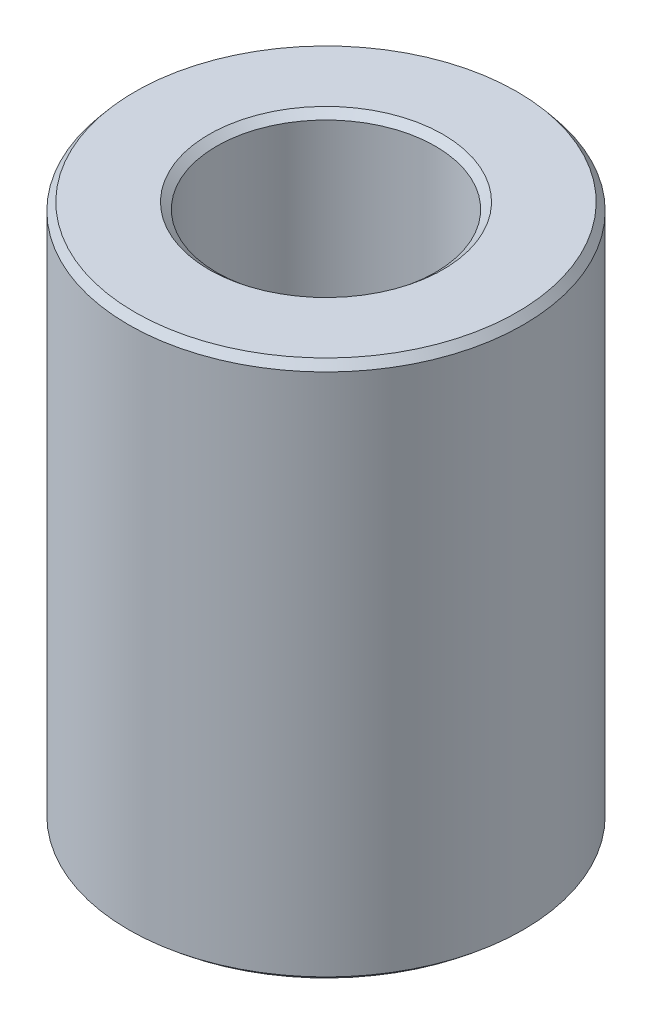
ISO-10303-21;
HEADER;
FILE_DESCRIPTION(('STEP AP214'),'2;1');
FILE_NAME('part.step','',(''),(''),'','','');
FILE_SCHEMA(('AUTOMOTIVE_DESIGN { 1 0 10303 214 1 1 1 1 }'));
ENDSEC;
DATA;
#1=APPLICATION_CONTEXT('core data for automotive mechanical design processes');
#2=APPLICATION_PROTOCOL_DEFINITION('international standard','automotive_design',2000,#1);
#3=PRODUCT_CONTEXT('',#1,'mechanical');
#4=PRODUCT('Part','Part','',(#3));
#5=PRODUCT_RELATED_PRODUCT_CATEGORY('part','',(#4));
#6=PRODUCT_DEFINITION_FORMATION('','',#4);
#7=PRODUCT_DEFINITION_CONTEXT('part definition',#1,'design');
#8=PRODUCT_DEFINITION('design','',#6,#7);
#9=PRODUCT_DEFINITION_SHAPE('','',#8);
#10=(LENGTH_UNIT() NAMED_UNIT(*) SI_UNIT(.MILLI.,.METRE.));
#11=(NAMED_UNIT(*) PLANE_ANGLE_UNIT() SI_UNIT($,.RADIAN.));
#12=(NAMED_UNIT(*) SI_UNIT($,.STERADIAN.) SOLID_ANGLE_UNIT());
#13=UNCERTAINTY_MEASURE_WITH_UNIT(LENGTH_MEASURE(1.E-05),#10,'distance_accuracy_value','');
#14=(GEOMETRIC_REPRESENTATION_CONTEXT(3) GLOBAL_UNCERTAINTY_ASSIGNED_CONTEXT((#13)) GLOBAL_UNIT_ASSIGNED_CONTEXT((#10,
#11,#12)) REPRESENTATION_CONTEXT('',''));
#15=CARTESIAN_POINT('',(0.,0.,0.));
#16=DIRECTION('',(0.,0.,1.));
#17=DIRECTION('',(1.,0.,0.));
#18=AXIS2_PLACEMENT_3D('',#15,#16,#17);
#19=CARTESIAN_POINT('',(0.,108.992177685298,0.));
#20=DIRECTION('',(0.,-1.,0.));
#21=DIRECTION('',(0.,0.,-1.));
#22=AXIS2_PLACEMENT_3D('',#19,#20,#21);
#23=CYLINDRICAL_SURFACE('',#22,40.);
#24=CARTESIAN_POINT('',(0.,1.28444051378342,0.));
#25=DIRECTION('',(0.,1.,0.));
#26=DIRECTION('',(0.,0.,1.));
#27=AXIS2_PLACEMENT_3D('',#24,#25,#26);
#28=CIRCLE('',#27,40.);
#29=CARTESIAN_POINT('',(0.,1.2844405137834,-40.));
#30=VERTEX_POINT('',#29);
#31=EDGE_CURVE('E10',#30,#30,#28,.T.);
#32=CARTESIAN_POINT('',(0.,107.43846933457,0.));
#33=DIRECTION('',(0.,1.,0.));
#34=DIRECTION('',(0.,0.,1.));
#35=AXIS2_PLACEMENT_3D('',#32,#33,#34);
#36=CIRCLE('',#35,40.);
#37=CARTESIAN_POINT('',(0.,107.43846933457,-40.));
#38=VERTEX_POINT('',#37);
#39=EDGE_CURVE('E50',#38,#38,#36,.F.);
#40=CARTESIAN_POINT('',(0.,1.2844405137834,-40.));
#41=CARTESIAN_POINT('',(0.,2.39021164733327,-40.));
#42=CARTESIAN_POINT('',(0.,3.49598278088313,-40.));
#43=CARTESIAN_POINT('',(0.,5.70752504798284,-40.));
#44=CARTESIAN_POINT('',(0.,6.8132961815327,-40.));
#45=CARTESIAN_POINT('',(0.,9.02483844863242,-40.));
#46=CARTESIAN_POINT('',(0.,10.1306095821823,-40.));
#47=CARTESIAN_POINT('',(0.,12.342151849282,-40.));
#48=CARTESIAN_POINT('',(0.,13.4479229828319,-40.));
#49=CARTESIAN_POINT('',(0.,15.6594652499316,-40.));
#50=CARTESIAN_POINT('',(0.,16.7652363834814,-40.));
#51=CARTESIAN_POINT('',(0.,18.9767786505812,-40.));
#52=CARTESIAN_POINT('',(0.,20.082549784131,-40.));
#53=CARTESIAN_POINT('',(0.,22.2940920512307,-40.));
#54=CARTESIAN_POINT('',(0.,23.3998631847806,-40.));
#55=CARTESIAN_POINT('',(0.,25.6114054518803,-40.));
#56=CARTESIAN_POINT('',(0.,26.7171765854302,-40.));
#57=CARTESIAN_POINT('',(0.,28.9287188525299,-40.));
#58=CARTESIAN_POINT('',(0.,30.0344899860798,-40.));
#59=CARTESIAN_POINT('',(0.,32.2460322531795,-40.));
#60=CARTESIAN_POINT('',(0.,33.3518033867293,-40.));
#61=CARTESIAN_POINT('',(0.,35.563345653829,-40.));
#62=CARTESIAN_POINT('',(0.,36.6691167873789,-40.));
#63=CARTESIAN_POINT('',(0.,38.8806590544786,-40.));
#64=CARTESIAN_POINT('',(0.,39.9864301880285,-40.));
#65=CARTESIAN_POINT('',(0.,42.1979724551282,-40.));
#66=CARTESIAN_POINT('',(0.,43.3037435886781,-40.));
#67=CARTESIAN_POINT('',(0.,45.5152858557778,-40.));
#68=CARTESIAN_POINT('',(0.,46.6210569893276,-40.));
#69=CARTESIAN_POINT('',(0.,48.8325992564274,-40.));
#70=CARTESIAN_POINT('',(0.,49.9383703899772,-40.));
#71=CARTESIAN_POINT('',(0.,52.1499126570769,-40.));
#72=CARTESIAN_POINT('',(0.,53.2556837906268,-40.));
#73=CARTESIAN_POINT('',(0.,55.4672260577265,-40.));
#74=CARTESIAN_POINT('',(0.,56.5729971912764,-40.));
#75=CARTESIAN_POINT('',(0.,58.7845394583761,-40.));
#76=CARTESIAN_POINT('',(0.,59.8903105919259,-40.));
#77=CARTESIAN_POINT('',(0.,62.1018528590257,-40.));
#78=CARTESIAN_POINT('',(0.,63.2076239925755,-40.));
#79=CARTESIAN_POINT('',(0.,65.4191662596752,-40.));
#80=CARTESIAN_POINT('',(0.,66.5249373932251,-40.));
#81=CARTESIAN_POINT('',(0.,68.7364796603248,-40.));
#82=CARTESIAN_POINT('',(0.,69.8422507938747,-40.));
#83=CARTESIAN_POINT('',(0.,72.0537930609744,-40.));
#84=CARTESIAN_POINT('',(0.,73.1595641945243,-40.));
#85=CARTESIAN_POINT('',(0.,75.371106461624,-40.));
#86=CARTESIAN_POINT('',(0.,76.4768775951738,-40.));
#87=CARTESIAN_POINT('',(0.,78.6884198622735,-40.));
#88=CARTESIAN_POINT('',(0.,79.7941909958234,-40.));
#89=CARTESIAN_POINT('',(0.,82.0057332629231,-40.));
#90=CARTESIAN_POINT('',(0.,83.111504396473,-40.));
#91=CARTESIAN_POINT('',(0.,85.3230466635727,-40.));
#92=CARTESIAN_POINT('',(0.,86.4288177971226,-40.));
#93=CARTESIAN_POINT('',(0.,88.6403600642223,-40.));
#94=CARTESIAN_POINT('',(0.,89.7461311977721,-40.));
#95=CARTESIAN_POINT('',(0.,91.9576734648719,-40.));
#96=CARTESIAN_POINT('',(0.,93.0634445984217,-40.));
#97=CARTESIAN_POINT('',(0.,95.2749868655214,-40.));
#98=CARTESIAN_POINT('',(0.,96.3807579990713,-40.));
#99=CARTESIAN_POINT('',(0.,98.592300266171,-40.));
#100=CARTESIAN_POINT('',(0.,99.6980713997209,-40.));
#101=CARTESIAN_POINT('',(0.,101.909613666821,-40.));
#102=CARTESIAN_POINT('',(0.,103.01538480037,-40.));
#103=CARTESIAN_POINT('',(0.,105.22692706747,-40.));
#104=CARTESIAN_POINT('',(0.,106.33269820102,-40.));
#105=CARTESIAN_POINT('',(0.,107.43846933457,-40.));
#106=B_SPLINE_CURVE_WITH_KNOTS('',3,(#40,#41,#42,#43,#44,#45,#46,#47,#48,#49,#50,#51,#52,#53,
#54,#55,#56,#57,#58,#59,#60,#61,#62,#63,#64,#65,#66,#67,#68,#69,#70,#71,#72,#73,#74,#75,#76,#77,
#78,#79,#80,#81,#82,#83,#84,#85,#86,#87,#88,#89,#90,#91,#92,#93,#94,#95,#96,#97,#98,#99,#100,
#101,#102,#103,#104,#105),.UNSPECIFIED.,.F.,.F.,(4,2,2,2,2,2,2,2,2,2,2,2,2,2,2,2,2,2,2,2,2,2,2,
2,2,2,2,2,2,2,2,2,4),(0.,3.31731340064959,6.63462680129916,9.95194020194873,13.2692536025983,
16.5865670032479,19.9038804038975,23.221193804547,26.5385072051966,29.8558206058462,
33.1731340064958,36.4904474071454,39.8077608077949,43.1250742084445,46.4423876090941,
49.7597010097437,53.0770144103932,56.3943278110428,59.7116412116924,63.028954612342,
66.3462680129916,69.6635814136412,72.9808948142907,76.2982082149403,79.6155216155899,
82.9328350162395,86.250148416889,89.5674618175386,92.8847752181882,96.2020886188378,
99.5194020194873,102.836715420137,106.154028820786),.UNSPECIFIED.);
#107=EDGE_CURVE('BSEAM39',#30,#38,#106,.T.);
#108=ORIENTED_EDGE('',*,*,#31,.T.);
#109=ORIENTED_EDGE('',*,*,#39,.T.);
#110=ORIENTED_EDGE('',*,*,#107,.T.);
#111=ORIENTED_EDGE('',*,*,#107,.F.);
#112=EDGE_LOOP('',(#108,#110,#109,#111));
#113=FACE_BOUND('',#112,.T.);
#114=ADVANCED_FACE('F39',(#113),#23,.T.);
#115=CARTESIAN_POINT('',(0.,108.992177685298,0.));
#116=DIRECTION('',(0.,1.,0.));
#117=DIRECTION('',(0.,0.,1.));
#118=AXIS2_PLACEMENT_3D('',#115,#116,#117);
#119=PLANE('',#118);
#120=CARTESIAN_POINT('',(0.,108.992177685298,0.));
#121=DIRECTION('',(0.,1.,0.));
#122=DIRECTION('',(0.,0.,1.));
#123=AXIS2_PLACEMENT_3D('',#120,#121,#122);
#124=CIRCLE('',#123,23.7200640801443);
#125=CARTESIAN_POINT('',(0.,108.992177685298,23.7200640801443));
#126=VERTEX_POINT('',#125);
#127=EDGE_CURVE('E58',#126,#126,#124,.F.);
#128=ORIENTED_EDGE('',*,*,#127,.T.);
#129=EDGE_LOOP('',(#128));
#130=FACE_BOUND('',#129,.T.);
#131=CARTESIAN_POINT('',(0.,108.992177685298,0.));
#132=DIRECTION('',(0.,1.,0.));
#133=DIRECTION('',(0.,0.,1.));
#134=AXIS2_PLACEMENT_3D('',#131,#132,#133);
#135=CIRCLE('',#134,38.7155594862167);
#136=CARTESIAN_POINT('',(0.,108.992177685298,38.7155594862167));
#137=VERTEX_POINT('',#136);
#138=EDGE_CURVE('E61',#137,#137,#135,.T.);
#139=ORIENTED_EDGE('',*,*,#138,.T.);
#140=EDGE_LOOP('',(#139));
#141=FACE_BOUND('',#140,.T.);
#142=ADVANCED_FACE('F88',(#130,#141),#119,.T.);
#143=CARTESIAN_POINT('',(0.,0.,0.));
#144=DIRECTION('',(0.,1.,0.));
#145=DIRECTION('',(0.,0.,1.));
#146=AXIS2_PLACEMENT_3D('',#143,#144,#145);
#147=PLANE('',#146);
#148=CARTESIAN_POINT('',(0.,0.,0.));
#149=DIRECTION('',(0.,1.,0.));
#150=DIRECTION('',(0.,0.,1.));
#151=AXIS2_PLACEMENT_3D('',#148,#149,#150);
#152=CIRCLE('',#151,23.4507962431998);
#153=CARTESIAN_POINT('',(0.,0.,23.4507962431998));
#154=VERTEX_POINT('',#153);
#155=EDGE_CURVE('E51',#154,#154,#152,.T.);
#156=ORIENTED_EDGE('',*,*,#155,.T.);
#157=EDGE_LOOP('',(#156));
#158=FACE_BOUND('',#157,.T.);
#159=CARTESIAN_POINT('',(0.,0.,0.));
#160=DIRECTION('',(0.,1.,0.));
#161=DIRECTION('',(0.,0.,1.));
#162=AXIS2_PLACEMENT_3D('',#159,#160,#161);
#163=CIRCLE('',#162,38.4462916492722);
#164=CARTESIAN_POINT('',(0.,0.,38.4462916492722));
#165=VERTEX_POINT('',#164);
#166=EDGE_CURVE('E54',#165,#165,#163,.F.);
#167=ORIENTED_EDGE('',*,*,#166,.T.);
#168=EDGE_LOOP('',(#167));
#169=FACE_BOUND('',#168,.T.);
#170=ADVANCED_FACE('F83',(#158,#169),#147,.F.);
#171=CARTESIAN_POINT('',(0.,108.992177685298,0.));
#172=DIRECTION('',(0.,-1.,0.));
#173=DIRECTION('',(0.,0.,-1.));
#174=AXIS2_PLACEMENT_3D('',#171,#172,#173);
#175=CYLINDRICAL_SURFACE('',#174,22.1663557294164);
#176=CARTESIAN_POINT('',(0.,107.707737171514,0.));
#177=DIRECTION('',(0.,1.,0.));
#178=DIRECTION('',(0.,0.,1.));
#179=AXIS2_PLACEMENT_3D('',#176,#177,#178);
#180=CIRCLE('',#179,22.1663557294164);
#181=CARTESIAN_POINT('',(0.,107.707737171514,-22.1663557294164));
#182=VERTEX_POINT('',#181);
#183=EDGE_CURVE('E67',#182,#182,#180,.T.);
#184=CARTESIAN_POINT('',(0.,1.55370835072773,0.));
#185=DIRECTION('',(0.,1.,0.));
#186=DIRECTION('',(0.,0.,1.));
#187=AXIS2_PLACEMENT_3D('',#184,#185,#186);
#188=CIRCLE('',#187,22.1663557294164);
#189=CARTESIAN_POINT('',(0.,1.55370835072771,-22.1663557294164));
#190=VERTEX_POINT('',#189);
#191=EDGE_CURVE('E69',#190,#190,#188,.F.);
#192=CARTESIAN_POINT('',(0.,107.707737171514,-22.1663557294164));
#193=CARTESIAN_POINT('',(0.,106.601966037964,-22.1663557294164));
#194=CARTESIAN_POINT('',(0.,105.496194904414,-22.1663557294164));
#195=CARTESIAN_POINT('',(0.,103.284652637315,-22.1663557294164));
#196=CARTESIAN_POINT('',(0.,102.178881503765,-22.1663557294164));
#197=CARTESIAN_POINT('',(0.,99.9673392366651,-22.1663557294164));
#198=CARTESIAN_POINT('',(0.,98.8615681031153,-22.1663557294164));
#199=CARTESIAN_POINT('',(0.,96.6500258360155,-22.1663557294164));
#200=CARTESIAN_POINT('',(0.,95.5442547024657,-22.1663557294164));
#201=CARTESIAN_POINT('',(0.,93.332712435366,-22.1663557294164));
#202=CARTESIAN_POINT('',(0.,92.2269413018161,-22.1663557294164));
#203=CARTESIAN_POINT('',(0.,90.0153990347164,-22.1663557294164));
#204=CARTESIAN_POINT('',(0.,88.9096279011665,-22.1663557294164));
#205=CARTESIAN_POINT('',(0.,86.6980856340668,-22.1663557294164));
#206=CARTESIAN_POINT('',(0.,85.5923145005169,-22.1663557294164));
#207=CARTESIAN_POINT('',(0.,83.3807722334172,-22.1663557294164));
#208=CARTESIAN_POINT('',(0.,82.2750010998674,-22.1663557294164));
#209=CARTESIAN_POINT('',(0.,80.0634588327677,-22.1663557294164));
#210=CARTESIAN_POINT('',(0.,78.9576876992178,-22.1663557294164));
#211=CARTESIAN_POINT('',(0.,76.7461454321181,-22.1663557294164));
#212=CARTESIAN_POINT('',(0.,75.6403742985682,-22.1663557294164));
#213=CARTESIAN_POINT('',(0.,73.4288320314685,-22.1663557294164));
#214=CARTESIAN_POINT('',(0.,72.3230608979187,-22.1663557294164));
#215=CARTESIAN_POINT('',(0.,70.1115186308189,-22.1663557294164));
#216=CARTESIAN_POINT('',(0.,69.0057474972691,-22.1663557294164));
#217=CARTESIAN_POINT('',(0.,66.7942052301694,-22.1663557294164));
#218=CARTESIAN_POINT('',(0.,65.6884340966195,-22.1663557294164));
#219=CARTESIAN_POINT('',(0.,63.4768918295198,-22.1663557294164));
#220=CARTESIAN_POINT('',(0.,62.3711206959699,-22.1663557294164));
#221=CARTESIAN_POINT('',(0.,60.1595784288702,-22.1663557294164));
#222=CARTESIAN_POINT('',(0.,59.0538072953204,-22.1663557294164));
#223=CARTESIAN_POINT('',(0.,56.8422650282206,-22.1663557294164));
#224=CARTESIAN_POINT('',(0.,55.7364938946708,-22.1663557294164));
#225=CARTESIAN_POINT('',(0.,53.5249516275711,-22.1663557294164));
#226=CARTESIAN_POINT('',(0.,52.4191804940212,-22.1663557294164));
#227=CARTESIAN_POINT('',(0.,50.2076382269215,-22.1663557294164));
#228=CARTESIAN_POINT('',(0.,49.1018670933716,-22.1663557294164));
#229=CARTESIAN_POINT('',(0.,46.8903248262719,-22.1663557294164));
#230=CARTESIAN_POINT('',(0.,45.784553692722,-22.1663557294164));
#231=CARTESIAN_POINT('',(0.,43.5730114256223,-22.1663557294164));
#232=CARTESIAN_POINT('',(0.,42.4672402920725,-22.1663557294164));
#233=CARTESIAN_POINT('',(0.,40.2556980249728,-22.1663557294164));
#234=CARTESIAN_POINT('',(0.,39.1499268914229,-22.1663557294164));
#235=CARTESIAN_POINT('',(0.,36.9383846243232,-22.1663557294164));
#236=CARTESIAN_POINT('',(0.,35.8326134907733,-22.1663557294164));
#237=CARTESIAN_POINT('',(0.,33.6210712236736,-22.1663557294164));
#238=CARTESIAN_POINT('',(0.,32.5153000901238,-22.1663557294164));
#239=CARTESIAN_POINT('',(0.,30.303757823024,-22.1663557294164));
#240=CARTESIAN_POINT('',(0.,29.1979866894742,-22.1663557294164));
#241=CARTESIAN_POINT('',(0.,26.9864444223745,-22.1663557294164));
#242=CARTESIAN_POINT('',(0.,25.8806732888246,-22.1663557294164));
#243=CARTESIAN_POINT('',(0.,23.6691310217249,-22.1663557294164));
#244=CARTESIAN_POINT('',(0.,22.563359888175,-22.1663557294164));
#245=CARTESIAN_POINT('',(0.,20.3518176210753,-22.1663557294164));
#246=CARTESIAN_POINT('',(0.,19.2460464875255,-22.1663557294164));
#247=CARTESIAN_POINT('',(0.,17.0345042204257,-22.1663557294164));
#248=CARTESIAN_POINT('',(0.,15.9287330868759,-22.1663557294164));
#249=CARTESIAN_POINT('',(0.,13.7171908197762,-22.1663557294164));
#250=CARTESIAN_POINT('',(0.,12.6114196862263,-22.1663557294164));
#251=CARTESIAN_POINT('',(0.,10.3998774191266,-22.1663557294164));
#252=CARTESIAN_POINT('',(0.,9.29410628557673,-22.1663557294164));
#253=CARTESIAN_POINT('',(0.,7.08256401847701,-22.1663557294164));
#254=CARTESIAN_POINT('',(0.,5.97679288492715,-22.1663557294164));
#255=CARTESIAN_POINT('',(0.,3.76525061782743,-22.1663557294164));
#256=CARTESIAN_POINT('',(0.,2.65947948427757,-22.1663557294164));
#257=CARTESIAN_POINT('',(0.,1.55370835072771,-22.1663557294164));
#258=B_SPLINE_CURVE_WITH_KNOTS('',3,(#192,#193,#194,#195,#196,#197,#198,#199,#200,#201,#202,
#203,#204,#205,#206,#207,#208,#209,#210,#211,#212,#213,#214,#215,#216,#217,#218,#219,#220,#221,
#222,#223,#224,#225,#226,#227,#228,#229,#230,#231,#232,#233,#234,#235,#236,#237,#238,#239,#240,
#241,#242,#243,#244,#245,#246,#247,#248,#249,#250,#251,#252,#253,#254,#255,#256,#257),
.UNSPECIFIED.,.F.,.F.,(4,2,2,2,2,2,2,2,2,2,2,2,2,2,2,2,2,2,2,2,2,2,2,2,2,2,2,2,2,2,2,2,4),(0.,
3.31731340064957,6.63462680129914,9.95194020194871,13.2692536025983,16.5865670032479,
19.9038804038974,23.221193804547,26.5385072051966,29.8558206058462,33.1731340064957,
36.4904474071453,39.8077608077949,43.1250742084445,46.442387609094,49.7597010097436,
53.0770144103932,56.3943278110428,59.7116412116923,63.0289546123419,66.3462680129915,
69.6635814136411,72.9808948142907,76.2982082149402,79.6155216155898,82.9328350162394,
86.2501484168889,89.5674618175385,92.8847752181881,96.2020886188377,99.5194020194872,
102.836715420137,106.154028820786),.UNSPECIFIED.);
#259=EDGE_CURVE('BSEAM71',#182,#190,#258,.T.);
#260=ORIENTED_EDGE('',*,*,#183,.T.);
#261=ORIENTED_EDGE('',*,*,#191,.T.);
#262=ORIENTED_EDGE('',*,*,#259,.T.);
#263=ORIENTED_EDGE('',*,*,#259,.F.);
#264=EDGE_LOOP('',(#260,#262,#261,#263));
#265=FACE_BOUND('',#264,.T.);
#266=ADVANCED_FACE('F71',(#265),#175,.F.);
#267=CARTESIAN_POINT('',(0.,107.707737171514,0.));
#268=DIRECTION('',(0.,1.,0.));
#269=DIRECTION('',(0.,0.,1.));
#270=AXIS2_PLACEMENT_3D('',#267,#268,#269);
#271=CONICAL_SURFACE('',#270,22.1663557294164,0.879989489392314);
#272=ORIENTED_EDGE('',*,*,#127,.F.);
#273=EDGE_LOOP('',(#272));
#274=FACE_BOUND('',#273,.T.);
#275=ORIENTED_EDGE('',*,*,#183,.F.);
#276=EDGE_LOOP('',(#275));
#277=FACE_BOUND('',#276,.T.);
#278=ADVANCED_FACE('F77',(#274,#277),#271,.F.);
#279=CARTESIAN_POINT('',(0.,0.,0.));
#280=DIRECTION('',(0.,-1.,0.));
#281=DIRECTION('',(0.,0.,-1.));
#282=AXIS2_PLACEMENT_3D('',#279,#280,#281);
#283=CONICAL_SURFACE('',#282,23.4507962431998,0.690806837402571);
#284=ORIENTED_EDGE('',*,*,#191,.F.);
#285=EDGE_LOOP('',(#284));
#286=FACE_BOUND('',#285,.T.);
#287=ORIENTED_EDGE('',*,*,#155,.F.);
#288=EDGE_LOOP('',(#287));
#289=FACE_BOUND('',#288,.T.);
#290=ADVANCED_FACE('F73',(#286,#289),#283,.F.);
#291=CARTESIAN_POINT('',(0.,1.28444051378342,0.));
#292=DIRECTION('',(0.,1.,0.));
#293=DIRECTION('',(0.,0.,1.));
#294=AXIS2_PLACEMENT_3D('',#291,#292,#293);
#295=CONICAL_SURFACE('',#294,40.,0.879989489392321);
#296=ORIENTED_EDGE('',*,*,#166,.F.);
#297=EDGE_LOOP('',(#296));
#298=FACE_BOUND('',#297,.T.);
#299=ORIENTED_EDGE('',*,*,#31,.F.);
#300=EDGE_LOOP('',(#299));
#301=FACE_BOUND('',#300,.T.);
#302=ADVANCED_FACE('F76',(#298,#301),#295,.T.);
#303=CARTESIAN_POINT('',(0.,108.992177685298,0.));
#304=DIRECTION('',(0.,-1.,0.));
#305=DIRECTION('',(0.,0.,-1.));
#306=AXIS2_PLACEMENT_3D('',#303,#304,#305);
#307=CONICAL_SURFACE('',#306,38.7155594862167,0.690806837402579);
#308=ORIENTED_EDGE('',*,*,#39,.F.);
#309=EDGE_LOOP('',(#308));
#310=FACE_BOUND('',#309,.T.);
#311=ORIENTED_EDGE('',*,*,#138,.F.);
#312=EDGE_LOOP('',(#311));
#313=FACE_BOUND('',#312,.T.);
#314=ADVANCED_FACE('F45',(#310,#313),#307,.T.);
#315=CLOSED_SHELL('',(#114,#142,#170,#266,#278,#290,#302,#314));
#316=MANIFOLD_SOLID_BREP('B2',#315);
#317=ADVANCED_BREP_SHAPE_REPRESENTATION('',(#18,#316),#14);
#318=SHAPE_DEFINITION_REPRESENTATION(#9,#317);
ENDSEC;
END-ISO-10303-21;
